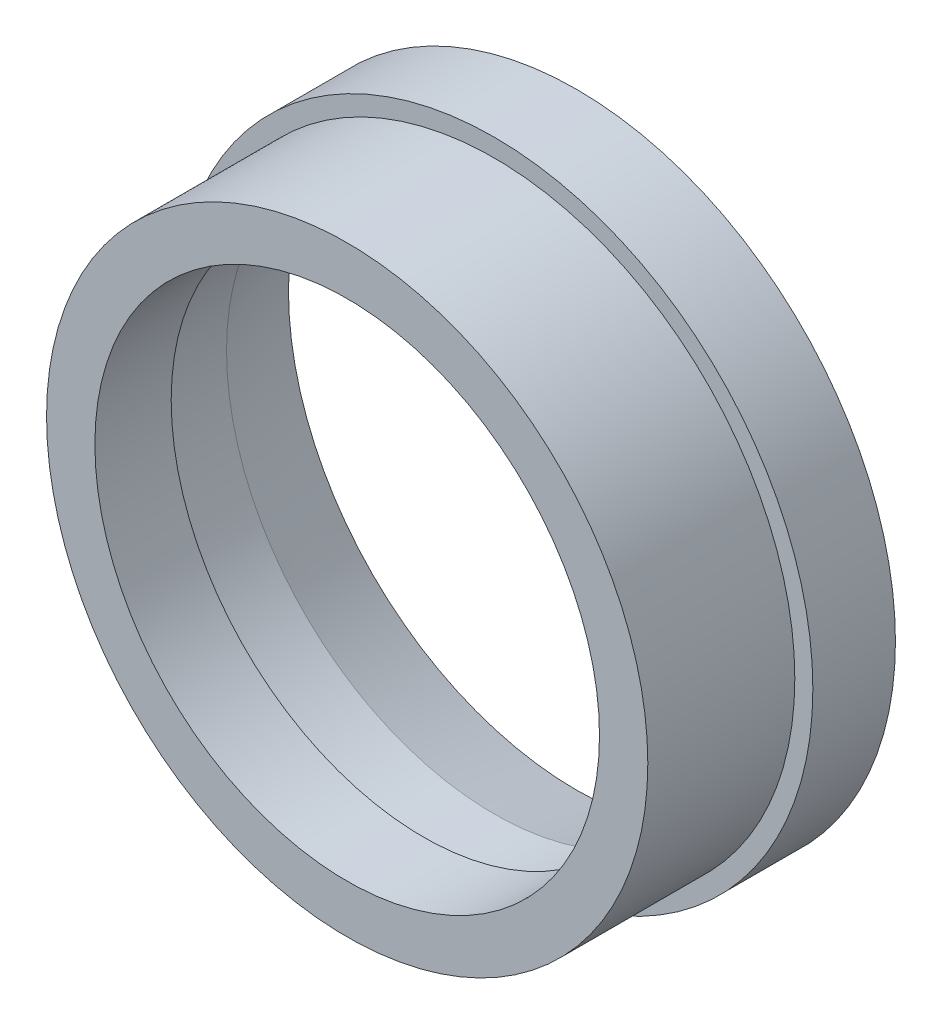
ISO-10303-21;
HEADER;
FILE_DESCRIPTION(('STEP AP214'),'2;1');
FILE_NAME('part.step','',(''),(''),'','','');
FILE_SCHEMA(('AUTOMOTIVE_DESIGN { 1 0 10303 214 1 1 1 1 }'));
ENDSEC;
DATA;
#1=APPLICATION_CONTEXT('core data for automotive mechanical design processes');
#2=APPLICATION_PROTOCOL_DEFINITION('international standard','automotive_design',2000,#1);
#3=PRODUCT_CONTEXT('',#1,'mechanical');
#4=PRODUCT('Part','Part','',(#3));
#5=PRODUCT_RELATED_PRODUCT_CATEGORY('part','',(#4));
#6=PRODUCT_DEFINITION_FORMATION('','',#4);
#7=PRODUCT_DEFINITION_CONTEXT('part definition',#1,'design');
#8=PRODUCT_DEFINITION('design','',#6,#7);
#9=PRODUCT_DEFINITION_SHAPE('','',#8);
#10=(LENGTH_UNIT() NAMED_UNIT(*) SI_UNIT(.MILLI.,.METRE.));
#11=(NAMED_UNIT(*) PLANE_ANGLE_UNIT() SI_UNIT($,.RADIAN.));
#12=(NAMED_UNIT(*) SI_UNIT($,.STERADIAN.) SOLID_ANGLE_UNIT());
#13=UNCERTAINTY_MEASURE_WITH_UNIT(LENGTH_MEASURE(1.E-05),#10,'distance_accuracy_value','');
#14=(GEOMETRIC_REPRESENTATION_CONTEXT(3) GLOBAL_UNCERTAINTY_ASSIGNED_CONTEXT((#13)) GLOBAL_UNIT_ASSIGNED_CONTEXT((#10,
#11,#12)) REPRESENTATION_CONTEXT('',''));
#15=CARTESIAN_POINT('',(0.,0.,0.));
#16=DIRECTION('',(0.,0.,1.));
#17=DIRECTION('',(1.,0.,0.));
#18=AXIS2_PLACEMENT_3D('',#15,#16,#17);
#19=CARTESIAN_POINT('',(0.,0.,35.306));
#20=DIRECTION('',(0.,0.,-1.));
#21=DIRECTION('',(-1.,0.,0.));
#22=AXIS2_PLACEMENT_3D('',#19,#20,#21);
#23=CYLINDRICAL_SURFACE('',#22,38.7985);
#24=CARTESIAN_POINT('',(0.,0.,35.306));
#25=DIRECTION('',(0.,0.,1.));
#26=DIRECTION('',(1.,0.,0.));
#27=AXIS2_PLACEMENT_3D('',#24,#25,#26);
#28=CIRCLE('',#27,38.7985);
#29=CARTESIAN_POINT('',(38.7985,0.,35.306));
#30=VERTEX_POINT('',#29);
#31=EDGE_CURVE('E52',#30,#30,#28,.T.);
#32=ORIENTED_EDGE('',*,*,#31,.T.);
#33=EDGE_LOOP('',(#32));
#34=FACE_BOUND('',#33,.T.);
#35=CARTESIAN_POINT('',(0.,0.,23.5712));
#36=DIRECTION('',(0.,0.,-1.));
#37=DIRECTION('',(-1.,0.,0.));
#38=AXIS2_PLACEMENT_3D('',#35,#36,#37);
#39=CIRCLE('',#38,38.7985);
#40=CARTESIAN_POINT('',(-38.7985,0.,23.5712));
#41=VERTEX_POINT('',#40);
#42=EDGE_CURVE('E55',#41,#41,#39,.T.);
#43=ORIENTED_EDGE('',*,*,#42,.T.);
#44=EDGE_LOOP('',(#43));
#45=FACE_BOUND('',#44,.T.);
#46=ADVANCED_FACE('F37',(#34,#45),#23,.F.);
#47=CARTESIAN_POINT('',(0.,0.,35.306));
#48=DIRECTION('',(0.,0.,1.));
#49=DIRECTION('',(1.,0.,0.));
#50=AXIS2_PLACEMENT_3D('',#47,#48,#49);
#51=PLANE('',#50);
#52=ORIENTED_EDGE('',*,*,#31,.F.);
#53=EDGE_LOOP('',(#52));
#54=FACE_BOUND('',#53,.T.);
#55=CARTESIAN_POINT('',(0.,0.,35.306));
#56=DIRECTION('',(0.,0.,1.));
#57=DIRECTION('',(1.,0.,0.));
#58=AXIS2_PLACEMENT_3D('',#55,#56,#57);
#59=CIRCLE('',#58,46.228);
#60=CARTESIAN_POINT('',(46.228,0.,35.306));
#61=VERTEX_POINT('',#60);
#62=EDGE_CURVE('E58',#61,#61,#59,.T.);
#63=ORIENTED_EDGE('',*,*,#62,.T.);
#64=EDGE_LOOP('',(#63));
#65=FACE_BOUND('',#64,.T.);
#66=ADVANCED_FACE('F89',(#54,#65),#51,.T.);
#67=CARTESIAN_POINT('',(0.,0.,35.306));
#68=DIRECTION('',(0.,0.,-1.));
#69=DIRECTION('',(-1.,0.,0.));
#70=AXIS2_PLACEMENT_3D('',#67,#68,#69);
#71=CYLINDRICAL_SURFACE('',#70,49.);
#72=CARTESIAN_POINT('',(0.,0.,0.));
#73=DIRECTION('',(0.,0.,1.));
#74=DIRECTION('',(1.,0.,0.));
#75=AXIS2_PLACEMENT_3D('',#72,#73,#74);
#76=CIRCLE('',#75,49.);
#77=CARTESIAN_POINT('',(49.,0.,0.));
#78=VERTEX_POINT('',#77);
#79=EDGE_CURVE('E48',#78,#78,#76,.T.);
#80=ORIENTED_EDGE('',*,*,#79,.T.);
#81=EDGE_LOOP('',(#80));
#82=FACE_BOUND('',#81,.T.);
#83=CARTESIAN_POINT('',(0.,0.,12.7));
#84=DIRECTION('',(0.,0.,1.));
#85=DIRECTION('',(1.,0.,0.));
#86=AXIS2_PLACEMENT_3D('',#83,#84,#85);
#87=CIRCLE('',#86,49.);
#88=CARTESIAN_POINT('',(49.,0.,12.7));
#89=VERTEX_POINT('',#88);
#90=EDGE_CURVE('E60',#89,#89,#87,.T.);
#91=ORIENTED_EDGE('',*,*,#90,.F.);
#92=EDGE_LOOP('',(#91));
#93=FACE_BOUND('',#92,.T.);
#94=ADVANCED_FACE('F95',(#82,#93),#71,.T.);
#95=CARTESIAN_POINT('',(0.,0.,0.));
#96=DIRECTION('',(0.,0.,1.));
#97=DIRECTION('',(1.,0.,0.));
#98=AXIS2_PLACEMENT_3D('',#95,#96,#97);
#99=PLANE('',#98);
#100=CARTESIAN_POINT('',(0.,0.,0.));
#101=DIRECTION('',(0.,0.,1.));
#102=DIRECTION('',(1.,0.,0.));
#103=AXIS2_PLACEMENT_3D('',#100,#101,#102);
#104=CIRCLE('',#103,44.3357000000001);
#105=CARTESIAN_POINT('',(44.3357000000001,0.,0.));
#106=VERTEX_POINT('',#105);
#107=EDGE_CURVE('E11',#106,#106,#104,.T.);
#108=ORIENTED_EDGE('',*,*,#107,.T.);
#109=EDGE_LOOP('',(#108));
#110=FACE_BOUND('',#109,.T.);
#111=ORIENTED_EDGE('',*,*,#79,.F.);
#112=EDGE_LOOP('',(#111));
#113=FACE_BOUND('',#112,.T.);
#114=ADVANCED_FACE('F101',(#110,#113),#99,.F.);
#115=CARTESIAN_POINT('',(0.,0.,12.7));
#116=DIRECTION('',(0.,0.,1.));
#117=DIRECTION('',(1.,0.,0.));
#118=AXIS2_PLACEMENT_3D('',#115,#116,#117);
#119=PLANE('',#118);
#120=CARTESIAN_POINT('',(0.,0.,12.7));
#121=DIRECTION('',(0.,0.,1.));
#122=DIRECTION('',(1.,0.,0.));
#123=AXIS2_PLACEMENT_3D('',#120,#121,#122);
#124=CIRCLE('',#123,46.228);
#125=CARTESIAN_POINT('',(46.228,0.,12.7));
#126=VERTEX_POINT('',#125);
#127=EDGE_CURVE('E62',#126,#126,#124,.T.);
#128=ORIENTED_EDGE('',*,*,#127,.F.);
#129=EDGE_LOOP('',(#128));
#130=FACE_BOUND('',#129,.T.);
#131=ORIENTED_EDGE('',*,*,#90,.T.);
#132=EDGE_LOOP('',(#131));
#133=FACE_BOUND('',#132,.T.);
#134=ADVANCED_FACE('F85',(#130,#133),#119,.T.);
#135=CARTESIAN_POINT('',(0.,0.,12.7));
#136=DIRECTION('',(0.,0.,1.));
#137=DIRECTION('',(1.,0.,0.));
#138=AXIS2_PLACEMENT_3D('',#135,#136,#137);
#139=CYLINDRICAL_SURFACE('',#138,46.228);
#140=ORIENTED_EDGE('',*,*,#127,.T.);
#141=EDGE_LOOP('',(#140));
#142=FACE_BOUND('',#141,.T.);
#143=ORIENTED_EDGE('',*,*,#62,.F.);
#144=EDGE_LOOP('',(#143));
#145=FACE_BOUND('',#144,.T.);
#146=ADVANCED_FACE('F77',(#142,#145),#139,.T.);
#147=CARTESIAN_POINT('',(0.,0.,23.5712));
#148=DIRECTION('',(0.,0.,-1.));
#149=DIRECTION('',(-1.,0.,0.));
#150=AXIS2_PLACEMENT_3D('',#147,#148,#149);
#151=CYLINDRICAL_SURFACE('',#150,41.1607);
#152=CARTESIAN_POINT('',(0.,0.,12.7000000000004));
#153=DIRECTION('',(0.,0.,1.));
#154=DIRECTION('',(1.,0.,0.));
#155=AXIS2_PLACEMENT_3D('',#152,#153,#154);
#156=CIRCLE('',#155,41.1607);
#157=CARTESIAN_POINT('',(41.1607,0.,12.7000000000004));
#158=VERTEX_POINT('',#157);
#159=EDGE_CURVE('E44',#158,#158,#156,.F.);
#160=ORIENTED_EDGE('',*,*,#159,.T.);
#161=EDGE_LOOP('',(#160));
#162=FACE_BOUND('',#161,.T.);
#163=CARTESIAN_POINT('',(0.,0.,23.5712));
#164=DIRECTION('',(0.,0.,-1.));
#165=DIRECTION('',(-1.,0.,0.));
#166=AXIS2_PLACEMENT_3D('',#163,#164,#165);
#167=CIRCLE('',#166,41.1607);
#168=CARTESIAN_POINT('',(-41.1607,0.,23.5712));
#169=VERTEX_POINT('',#168);
#170=EDGE_CURVE('E59',#169,#169,#167,.T.);
#171=ORIENTED_EDGE('',*,*,#170,.F.);
#172=EDGE_LOOP('',(#171));
#173=FACE_BOUND('',#172,.T.);
#174=ADVANCED_FACE('F75',(#162,#173),#151,.F.);
#175=CARTESIAN_POINT('',(0.,0.,23.5712));
#176=DIRECTION('',(0.,0.,-1.));
#177=DIRECTION('',(-1.,0.,0.));
#178=AXIS2_PLACEMENT_3D('',#175,#176,#177);
#179=PLANE('',#178);
#180=ORIENTED_EDGE('',*,*,#42,.F.);
#181=EDGE_LOOP('',(#180));
#182=FACE_BOUND('',#181,.T.);
#183=ORIENTED_EDGE('',*,*,#170,.T.);
#184=EDGE_LOOP('',(#183));
#185=FACE_BOUND('',#184,.T.);
#186=ADVANCED_FACE('F73',(#182,#185),#179,.T.);
#187=CARTESIAN_POINT('',(0.,0.,12.7000000000004));
#188=DIRECTION('',(0.,0.,-1.));
#189=DIRECTION('',(-1.,0.,0.));
#190=AXIS2_PLACEMENT_3D('',#187,#188,#189);
#191=CONICAL_SURFACE('',#190,41.1607,0.244978663126861);
#192=ORIENTED_EDGE('',*,*,#107,.F.);
#193=EDGE_LOOP('',(#192));
#194=FACE_BOUND('',#193,.T.);
#195=ORIENTED_EDGE('',*,*,#159,.F.);
#196=EDGE_LOOP('',(#195));
#197=FACE_BOUND('',#196,.T.);
#198=ADVANCED_FACE('F39',(#194,#197),#191,.F.);
#199=CLOSED_SHELL('',(#46,#66,#94,#114,#134,#146,#174,#186,#198));
#200=MANIFOLD_SOLID_BREP('B2',#199);
#201=ADVANCED_BREP_SHAPE_REPRESENTATION('',(#18,#200),#14);
#202=SHAPE_DEFINITION_REPRESENTATION(#9,#201);
ENDSEC;
END-ISO-10303-21;
